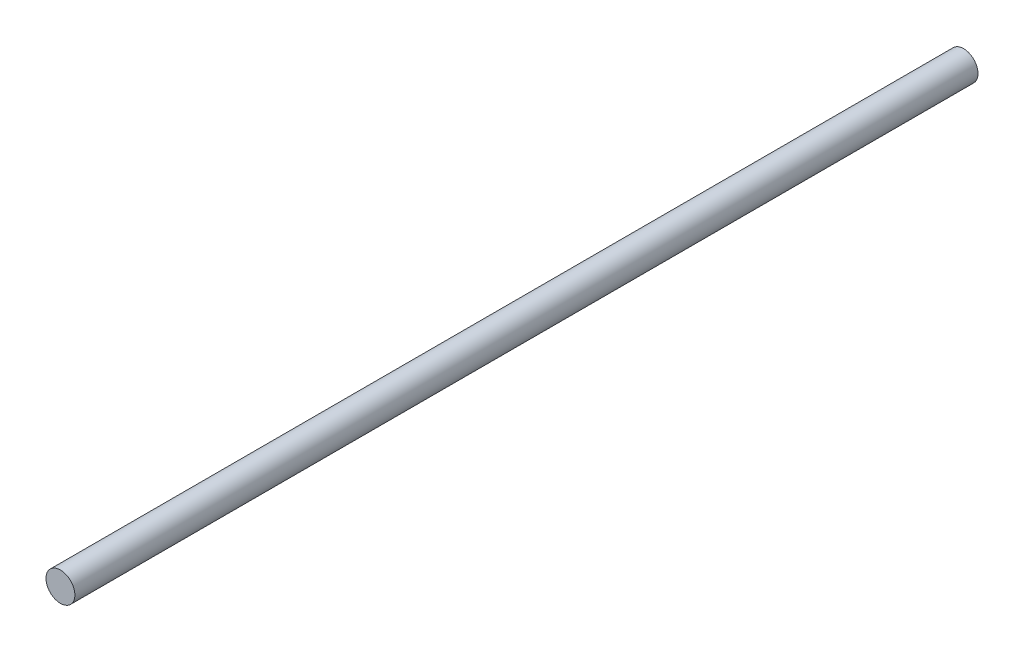
ISO-10303-21;
HEADER;
FILE_DESCRIPTION(('STEP AP214'),'2;1');
FILE_NAME('part.step','',(''),(''),'','','');
FILE_SCHEMA(('AUTOMOTIVE_DESIGN { 1 0 10303 214 1 1 1 1 }'));
ENDSEC;
DATA;
#1=APPLICATION_CONTEXT('core data for automotive mechanical design processes');
#2=APPLICATION_PROTOCOL_DEFINITION('international standard','automotive_design',2000,#1);
#3=PRODUCT_CONTEXT('',#1,'mechanical');
#4=PRODUCT('Part','Part','',(#3));
#5=PRODUCT_RELATED_PRODUCT_CATEGORY('part','',(#4));
#6=PRODUCT_DEFINITION_FORMATION('','',#4);
#7=PRODUCT_DEFINITION_CONTEXT('part definition',#1,'design');
#8=PRODUCT_DEFINITION('design','',#6,#7);
#9=PRODUCT_DEFINITION_SHAPE('','',#8);
#10=(LENGTH_UNIT() NAMED_UNIT(*) SI_UNIT(.MILLI.,.METRE.));
#11=(NAMED_UNIT(*) PLANE_ANGLE_UNIT() SI_UNIT($,.RADIAN.));
#12=(NAMED_UNIT(*) SI_UNIT($,.STERADIAN.) SOLID_ANGLE_UNIT());
#13=UNCERTAINTY_MEASURE_WITH_UNIT(LENGTH_MEASURE(1.E-05),#10,'distance_accuracy_value','');
#14=(GEOMETRIC_REPRESENTATION_CONTEXT(3) GLOBAL_UNCERTAINTY_ASSIGNED_CONTEXT((#13)) GLOBAL_UNIT_ASSIGNED_CONTEXT((#10,
#11,#12)) REPRESENTATION_CONTEXT('',''));
#15=CARTESIAN_POINT('',(0.,0.,0.));
#16=DIRECTION('',(0.,0.,1.));
#17=DIRECTION('',(1.,0.,0.));
#18=AXIS2_PLACEMENT_3D('',#15,#16,#17);
#19=CARTESIAN_POINT('',(0.,0.,375.));
#20=DIRECTION('',(0.,0.,-1.));
#21=DIRECTION('',(-1.,0.,0.));
#22=AXIS2_PLACEMENT_3D('',#19,#20,#21);
#23=CYLINDRICAL_SURFACE('',#22,6.);
#24=CARTESIAN_POINT('',(0.,0.,375.));
#25=DIRECTION('',(0.,0.,1.));
#26=DIRECTION('',(1.,0.,0.));
#27=AXIS2_PLACEMENT_3D('',#24,#25,#26);
#28=CIRCLE('',#27,6.);
#29=CARTESIAN_POINT('',(6.,0.,375.));
#30=VERTEX_POINT('',#29);
#31=EDGE_CURVE('E10',#30,#30,#28,.T.);
#32=ORIENTED_EDGE('',*,*,#31,.F.);
#33=EDGE_LOOP('',(#32));
#34=FACE_BOUND('',#33,.T.);
#35=CARTESIAN_POINT('',(0.,0.,0.));
#36=DIRECTION('',(0.,0.,1.));
#37=DIRECTION('',(1.,0.,0.));
#38=AXIS2_PLACEMENT_3D('',#35,#36,#37);
#39=CIRCLE('',#38,6.);
#40=CARTESIAN_POINT('',(6.,0.,0.));
#41=VERTEX_POINT('',#40);
#42=EDGE_CURVE('E37',#41,#41,#39,.T.);
#43=ORIENTED_EDGE('',*,*,#42,.T.);
#44=EDGE_LOOP('',(#43));
#45=FACE_BOUND('',#44,.T.);
#46=ADVANCED_FACE('F34',(#34,#45),#23,.T.);
#47=CARTESIAN_POINT('',(0.,0.,375.));
#48=DIRECTION('',(0.,0.,1.));
#49=DIRECTION('',(1.,0.,0.));
#50=AXIS2_PLACEMENT_3D('',#47,#48,#49);
#51=PLANE('',#50);
#52=ORIENTED_EDGE('',*,*,#31,.T.);
#53=EDGE_LOOP('',(#52));
#54=FACE_BOUND('',#53,.T.);
#55=ADVANCED_FACE('F49',(#54),#51,.T.);
#56=CARTESIAN_POINT('',(0.,0.,0.));
#57=DIRECTION('',(0.,0.,1.));
#58=DIRECTION('',(1.,0.,0.));
#59=AXIS2_PLACEMENT_3D('',#56,#57,#58);
#60=PLANE('',#59);
#61=ORIENTED_EDGE('',*,*,#42,.F.);
#62=EDGE_LOOP('',(#61));
#63=FACE_BOUND('',#62,.T.);
#64=ADVANCED_FACE('F47',(#63),#60,.F.);
#65=CLOSED_SHELL('',(#46,#55,#64));
#66=MANIFOLD_SOLID_BREP('B2',#65);
#67=ADVANCED_BREP_SHAPE_REPRESENTATION('',(#18,#66),#14);
#68=SHAPE_DEFINITION_REPRESENTATION(#9,#67);
ENDSEC;
END-ISO-10303-21;
